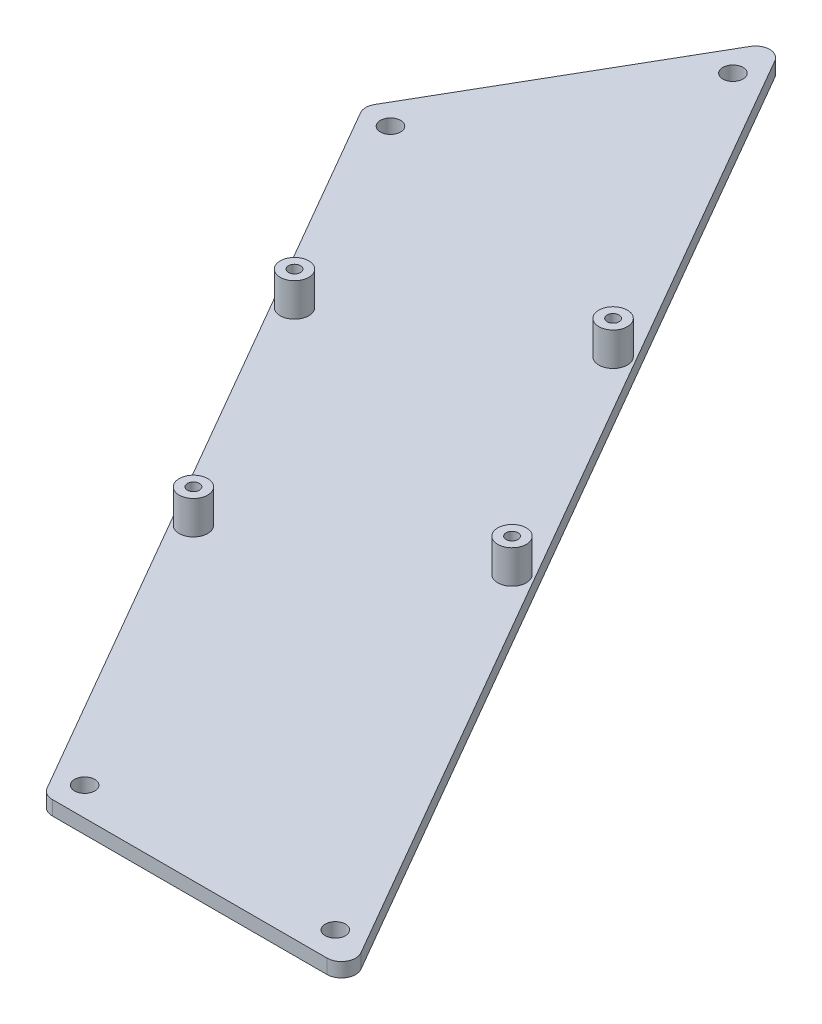
ISO-10303-21;
HEADER;
FILE_DESCRIPTION(('STEP AP214'),'2;1');
FILE_NAME('part.step','',(''),(''),'','','');
FILE_SCHEMA(('AUTOMOTIVE_DESIGN { 1 0 10303 214 1 1 1 1 }'));
ENDSEC;
DATA;
#1=APPLICATION_CONTEXT('core data for automotive mechanical design processes');
#2=APPLICATION_PROTOCOL_DEFINITION('international standard','automotive_design',2000,#1);
#3=PRODUCT_CONTEXT('',#1,'mechanical');
#4=PRODUCT('Part','Part','',(#3));
#5=PRODUCT_RELATED_PRODUCT_CATEGORY('part','',(#4));
#6=PRODUCT_DEFINITION_FORMATION('','',#4);
#7=PRODUCT_DEFINITION_CONTEXT('part definition',#1,'design');
#8=PRODUCT_DEFINITION('design','',#6,#7);
#9=PRODUCT_DEFINITION_SHAPE('','',#8);
#10=(LENGTH_UNIT() NAMED_UNIT(*) SI_UNIT(.MILLI.,.METRE.));
#11=(NAMED_UNIT(*) PLANE_ANGLE_UNIT() SI_UNIT($,.RADIAN.));
#12=(NAMED_UNIT(*) SI_UNIT($,.STERADIAN.) SOLID_ANGLE_UNIT());
#13=UNCERTAINTY_MEASURE_WITH_UNIT(LENGTH_MEASURE(1.E-05),#10,'distance_accuracy_value','');
#14=(GEOMETRIC_REPRESENTATION_CONTEXT(3) GLOBAL_UNCERTAINTY_ASSIGNED_CONTEXT((#13)) GLOBAL_UNIT_ASSIGNED_CONTEXT((#10,
#11,#12)) REPRESENTATION_CONTEXT('',''));
#15=CARTESIAN_POINT('',(0.,0.,0.));
#16=DIRECTION('',(0.,0.,1.));
#17=DIRECTION('',(1.,0.,0.));
#18=AXIS2_PLACEMENT_3D('',#15,#16,#17);
#19=CARTESIAN_POINT('',(173.,3.,6.00000000000005));
#20=DIRECTION('',(0.,0.,-1.));
#21=DIRECTION('',(-1.,0.,0.));
#22=AXIS2_PLACEMENT_3D('',#19,#20,#21);
#23=PLANE('',#22);
#24=DIRECTION('',(1.,0.,0.));
#25=VECTOR('',#24,1.);
#26=CARTESIAN_POINT('',(173.,3.,6.00000000000005));
#27=LINE('',#26,#25);
#28=CARTESIAN_POINT('',(174.732050807569,3.,6.00000000000005));
#29=VERTEX_POINT('',#28);
#30=CARTESIAN_POINT('',(232.467077726531,3.,6.00000000000005));
#31=VERTEX_POINT('',#30);
#32=EDGE_CURVE('E127',#29,#31,#27,.T.);
#33=ORIENTED_EDGE('',*,*,#32,.F.);
#34=DIRECTION('',(0.,-1.,0.));
#35=VECTOR('',#34,1.);
#36=CARTESIAN_POINT('',(174.732050807569,3.,6.00000000000005));
#37=LINE('',#36,#35);
#38=CARTESIAN_POINT('',(174.732050807569,0.,6.00000000000005));
#39=VERTEX_POINT('',#38);
#40=EDGE_CURVE('E11',#29,#39,#37,.T.);
#41=ORIENTED_EDGE('',*,*,#40,.T.);
#42=DIRECTION('',(1.,0.,0.));
#43=VECTOR('',#42,1.);
#44=CARTESIAN_POINT('',(173.,0.,6.00000000000005));
#45=LINE('',#44,#43);
#46=CARTESIAN_POINT('',(232.467077726531,0.,6.00000000000005));
#47=VERTEX_POINT('',#46);
#48=EDGE_CURVE('E158',#39,#47,#45,.T.);
#49=ORIENTED_EDGE('',*,*,#48,.T.);
#50=DIRECTION('',(0.,-1.,0.));
#51=VECTOR('',#50,1.);
#52=CARTESIAN_POINT('',(232.467077726531,3.,6.00000000000005));
#53=LINE('',#52,#51);
#54=EDGE_CURVE('E41',#47,#31,#53,.F.);
#55=ORIENTED_EDGE('',*,*,#54,.T.);
#56=EDGE_LOOP('',(#33,#41,#49,#55));
#57=FACE_BOUND('',#56,.T.);
#58=ADVANCED_FACE('F33',(#57),#23,.F.);
#59=CARTESIAN_POINT('',(237.663230149238,3.,6.00000000000005));
#60=DIRECTION('',(-0.866025403784439,0.,0.5));
#61=DIRECTION('',(0.5,0.,0.866025403784439));
#62=AXIS2_PLACEMENT_3D('',#59,#60,#61);
#63=PLANE('',#62);
#64=DIRECTION('',(-0.5,0.,-0.866025403784439));
#65=VECTOR('',#64,1.);
#66=CARTESIAN_POINT('',(237.663230149238,0.,6.00000000000005));
#67=LINE('',#66,#65);
#68=CARTESIAN_POINT('',(235.065153937885,0.,1.50000000000006));
#69=VERTEX_POINT('',#68);
#70=CARTESIAN_POINT('',(116.233538863266,0.,-204.322394854708));
#71=VERTEX_POINT('',#70);
#72=EDGE_CURVE('E132',#69,#71,#67,.T.);
#73=ORIENTED_EDGE('',*,*,#72,.T.);
#74=DIRECTION('',(0.,-1.,0.));
#75=VECTOR('',#74,1.);
#76=CARTESIAN_POINT('',(116.233538863266,3.,-204.322394854708));
#77=LINE('',#76,#75);
#78=CARTESIAN_POINT('',(116.233538863266,3.,-204.322394854708));
#79=VERTEX_POINT('',#78);
#80=EDGE_CURVE('E48',#71,#79,#77,.F.);
#81=ORIENTED_EDGE('',*,*,#80,.T.);
#82=DIRECTION('',(-0.5,0.,-0.866025403784439));
#83=VECTOR('',#82,1.);
#84=CARTESIAN_POINT('',(237.663230149238,3.,6.00000000000005));
#85=LINE('',#84,#83);
#86=CARTESIAN_POINT('',(235.065153937885,3.,1.50000000000006));
#87=VERTEX_POINT('',#86);
#88=EDGE_CURVE('E130',#87,#79,#85,.T.);
#89=ORIENTED_EDGE('',*,*,#88,.F.);
#90=DIRECTION('',(0.,-1.,0.));
#91=VECTOR('',#90,1.);
#92=CARTESIAN_POINT('',(235.065153937885,3.,1.50000000000005));
#93=LINE('',#92,#91);
#94=EDGE_CURVE('E150',#87,#69,#93,.T.);
#95=ORIENTED_EDGE('',*,*,#94,.T.);
#96=EDGE_LOOP('',(#73,#81,#89,#95));
#97=FACE_BOUND('',#96,.T.);
#98=ADVANCED_FACE('F165',(#97),#63,.F.);
#99=CARTESIAN_POINT('',(81.3038475772934,3.,-152.822394854708));
#100=DIRECTION('',(0.866025403784438,0.,0.500000000000001));
#101=DIRECTION('',(0.500000000000001,0.,-0.866025403784438));
#102=AXIS2_PLACEMENT_3D('',#99,#100,#101);
#103=PLANE('',#102);
#104=DIRECTION('',(-0.500000000000001,0.,0.866025403784438));
#105=VECTOR('',#104,1.);
#106=CARTESIAN_POINT('',(81.3038475772934,0.,-152.822394854708));
#107=LINE('',#106,#105);
#108=CARTESIAN_POINT('',(111.037386440559,0.,-204.322394854708));
#109=VERTEX_POINT('',#108);
#110=CARTESIAN_POINT('',(82.1698729810778,0.,-154.322394854708));
#111=VERTEX_POINT('',#110);
#112=EDGE_CURVE('E128',#109,#111,#107,.T.);
#113=ORIENTED_EDGE('',*,*,#112,.T.);
#114=DIRECTION('',(0.,-1.,0.));
#115=VECTOR('',#114,1.);
#116=CARTESIAN_POINT('',(82.1698729810778,3.,-154.322394854708));
#117=LINE('',#116,#115);
#118=CARTESIAN_POINT('',(82.1698729810778,3.,-154.322394854708));
#119=VERTEX_POINT('',#118);
#120=EDGE_CURVE('E105',#111,#119,#117,.F.);
#121=ORIENTED_EDGE('',*,*,#120,.T.);
#122=DIRECTION('',(-0.500000000000001,0.,0.866025403784438));
#123=VECTOR('',#122,1.);
#124=CARTESIAN_POINT('',(81.3038475772934,3.,-152.822394854708));
#125=LINE('',#124,#123);
#126=CARTESIAN_POINT('',(111.037386440559,3.,-204.322394854708));
#127=VERTEX_POINT('',#126);
#128=EDGE_CURVE('E170',#127,#119,#125,.T.);
#129=ORIENTED_EDGE('',*,*,#128,.F.);
#130=DIRECTION('',(0.,-1.,0.));
#131=VECTOR('',#130,1.);
#132=CARTESIAN_POINT('',(111.037386440559,3.,-204.322394854708));
#133=LINE('',#132,#131);
#134=EDGE_CURVE('E110',#127,#109,#133,.T.);
#135=ORIENTED_EDGE('',*,*,#134,.T.);
#136=EDGE_LOOP('',(#113,#121,#129,#135));
#137=FACE_BOUND('',#136,.T.);
#138=ADVANCED_FACE('F290',(#137),#103,.F.);
#139=CARTESIAN_POINT('',(81.3038475772934,3.,-152.822394854708));
#140=DIRECTION('',(0.866025403784439,0.,-0.5));
#141=DIRECTION('',(-0.5,0.,-0.866025403784439));
#142=AXIS2_PLACEMENT_3D('',#139,#140,#141);
#143=PLANE('',#142);
#144=DIRECTION('',(0.5,0.,0.866025403784439));
#145=VECTOR('',#144,1.);
#146=CARTESIAN_POINT('',(81.3038475772934,3.,-152.822394854708));
#147=LINE('',#146,#145);
#148=CARTESIAN_POINT('',(82.1698729810778,3.,-151.322394854708));
#149=VERTEX_POINT('',#148);
#150=CARTESIAN_POINT('',(172.133974596215,3.,4.5));
#151=VERTEX_POINT('',#150);
#152=EDGE_CURVE('E120',#149,#151,#147,.T.);
#153=ORIENTED_EDGE('',*,*,#152,.F.);
#154=DIRECTION('',(0.,-1.,0.));
#155=VECTOR('',#154,1.);
#156=CARTESIAN_POINT('',(82.1698729810778,3.,-151.322394854708));
#157=LINE('',#156,#155);
#158=CARTESIAN_POINT('',(82.1698729810778,0.,-151.322394854708));
#159=VERTEX_POINT('',#158);
#160=EDGE_CURVE('E104',#149,#159,#157,.T.);
#161=ORIENTED_EDGE('',*,*,#160,.T.);
#162=DIRECTION('',(0.5,0.,0.866025403784439));
#163=VECTOR('',#162,1.);
#164=CARTESIAN_POINT('',(81.3038475772934,0.,-152.822394854708));
#165=LINE('',#164,#163);
#166=CARTESIAN_POINT('',(172.133974596215,0.,4.5));
#167=VERTEX_POINT('',#166);
#168=EDGE_CURVE('E117',#159,#167,#165,.T.);
#169=ORIENTED_EDGE('',*,*,#168,.T.);
#170=DIRECTION('',(0.,-1.,0.));
#171=VECTOR('',#170,1.);
#172=CARTESIAN_POINT('',(172.133974596215,3.,4.50000000000003));
#173=LINE('',#172,#171);
#174=EDGE_CURVE('E122',#167,#151,#173,.F.);
#175=ORIENTED_EDGE('',*,*,#174,.T.);
#176=EDGE_LOOP('',(#153,#161,#169,#175));
#177=FACE_BOUND('',#176,.T.);
#178=ADVANCED_FACE('F116',(#177),#143,.F.);
#179=CARTESIAN_POINT('',(0.,3.,0.));
#180=DIRECTION('',(0.,1.,0.));
#181=DIRECTION('',(0.,0.,1.));
#182=AXIS2_PLACEMENT_3D('',#179,#180,#181);
#183=PLANE('',#182);
#184=CARTESIAN_POINT('',(87.7679491924311,3.,-152.018547277414));
#185=DIRECTION('',(0.,1.,0.));
#186=DIRECTION('',(0.,0.,1.));
#187=AXIS2_PLACEMENT_3D('',#184,#185,#186);
#188=CIRCLE('',#187,2.125);
#189=CARTESIAN_POINT('',(87.7679491924311,3.,-149.893547277414));
#190=VERTEX_POINT('',#189);
#191=EDGE_CURVE('E239',#190,#190,#188,.T.);
#192=ORIENTED_EDGE('',*,*,#191,.F.);
#193=EDGE_LOOP('',(#192));
#194=FACE_BOUND('',#193,.T.);
#195=CARTESIAN_POINT('',(114.09956426705,3.,-197.626242432001));
#196=DIRECTION('',(0.,1.,0.));
#197=DIRECTION('',(0.,0.,1.));
#198=AXIS2_PLACEMENT_3D('',#195,#196,#197);
#199=CIRCLE('',#198,2.125);
#200=CARTESIAN_POINT('',(114.09956426705,3.,-195.501242432001));
#201=VERTEX_POINT('',#200);
#202=EDGE_CURVE('E233',#201,#201,#199,.T.);
#203=ORIENTED_EDGE('',*,*,#202,.F.);
#204=EDGE_LOOP('',(#203));
#205=FACE_BOUND('',#204,.T.);
#206=CARTESIAN_POINT('',(175.535898384862,3.,0.));
#207=DIRECTION('',(0.,1.,0.));
#208=DIRECTION('',(0.,0.,1.));
#209=AXIS2_PLACEMENT_3D('',#206,#207,#208);
#210=CIRCLE('',#209,2.12499999999998);
#211=CARTESIAN_POINT('',(175.535898384862,3.,2.12500000000002));
#212=VERTEX_POINT('',#211);
#213=EDGE_CURVE('E227',#212,#212,#210,.T.);
#214=ORIENTED_EDGE('',*,*,#213,.F.);
#215=EDGE_LOOP('',(#214));
#216=FACE_BOUND('',#215,.T.);
#217=CARTESIAN_POINT('',(228.1991285341,3.,0.));
#218=DIRECTION('',(0.,1.,0.));
#219=DIRECTION('',(0.,0.,1.));
#220=AXIS2_PLACEMENT_3D('',#217,#218,#219);
#221=CIRCLE('',#220,2.12499999999998);
#222=CARTESIAN_POINT('',(228.1991285341,3.,2.12500000000002));
#223=VERTEX_POINT('',#222);
#224=EDGE_CURVE('E221',#223,#223,#221,.T.);
#225=ORIENTED_EDGE('',*,*,#224,.F.);
#226=EDGE_LOOP('',(#225));
#227=FACE_BOUND('',#226,.T.);
#228=CARTESIAN_POINT('',(139.683012701892,3.,-58.7067147554495));
#229=DIRECTION('',(0.,1.,0.));
#230=DIRECTION('',(0.,0.,1.));
#231=AXIS2_PLACEMENT_3D('',#228,#229,#230);
#232=CIRCLE('',#231,2.99999999999999);
#233=CARTESIAN_POINT('',(139.683012701892,3.,-55.7067147554495));
#234=VERTEX_POINT('',#233);
#235=EDGE_CURVE('E191',#234,#234,#232,.T.);
#236=ORIENTED_EDGE('',*,*,#235,.F.);
#237=EDGE_LOOP('',(#236));
#238=FACE_BOUND('',#237,.T.);
#239=CARTESIAN_POINT('',(182.11825748733,3.,-83.2067147554495));
#240=DIRECTION('',(0.,1.,0.));
#241=DIRECTION('',(0.,0.,1.));
#242=AXIS2_PLACEMENT_3D('',#239,#240,#241);
#243=CIRCLE('',#242,2.99999999999999);
#244=CARTESIAN_POINT('',(182.11825748733,3.,-80.2067147554496));
#245=VERTEX_POINT('',#244);
#246=EDGE_CURVE('E185',#245,#245,#243,.T.);
#247=ORIENTED_EDGE('',*,*,#246,.F.);
#248=EDGE_LOOP('',(#247));
#249=FACE_BOUND('',#248,.T.);
#250=CARTESIAN_POINT('',(153.11825748733,3.,-133.436188174947));
#251=DIRECTION('',(0.,1.,0.));
#252=DIRECTION('',(0.,0.,1.));
#253=AXIS2_PLACEMENT_3D('',#250,#251,#252);
#254=CIRCLE('',#253,2.99999999999999);
#255=CARTESIAN_POINT('',(153.11825748733,3.,-130.436188174947));
#256=VERTEX_POINT('',#255);
#257=EDGE_CURVE('E179',#256,#256,#254,.T.);
#258=ORIENTED_EDGE('',*,*,#257,.F.);
#259=EDGE_LOOP('',(#258));
#260=FACE_BOUND('',#259,.T.);
#261=CARTESIAN_POINT('',(110.683012701892,3.,-108.936188174947));
#262=DIRECTION('',(0.,1.,0.));
#263=DIRECTION('',(0.,0.,1.));
#264=AXIS2_PLACEMENT_3D('',#261,#262,#263);
#265=CIRCLE('',#264,3.);
#266=CARTESIAN_POINT('',(110.683012701892,3.,-105.936188174947));
#267=VERTEX_POINT('',#266);
#268=EDGE_CURVE('E173',#267,#267,#265,.T.);
#269=ORIENTED_EDGE('',*,*,#268,.F.);
#270=EDGE_LOOP('',(#269));
#271=FACE_BOUND('',#270,.T.);
#272=ORIENTED_EDGE('',*,*,#128,.T.);
#273=CARTESIAN_POINT('',(84.7679491924311,3.,-152.822394854708));
#274=DIRECTION('',(0.,1.,0.));
#275=DIRECTION('',(0.,0.,1.));
#276=AXIS2_PLACEMENT_3D('',#273,#274,#275);
#277=CIRCLE('',#276,3.);
#278=EDGE_CURVE('E148',#119,#149,#277,.T.);
#279=ORIENTED_EDGE('',*,*,#278,.T.);
#280=ORIENTED_EDGE('',*,*,#152,.T.);
#281=CARTESIAN_POINT('',(174.732050807569,3.,3.00000000000005));
#282=DIRECTION('',(0.,1.,0.));
#283=DIRECTION('',(0.,0.,1.));
#284=AXIS2_PLACEMENT_3D('',#281,#282,#283);
#285=CIRCLE('',#284,3.);
#286=EDGE_CURVE('E144',#151,#29,#285,.T.);
#287=ORIENTED_EDGE('',*,*,#286,.T.);
#288=ORIENTED_EDGE('',*,*,#32,.T.);
#289=CARTESIAN_POINT('',(232.467077726531,3.,3.00000000000005));
#290=DIRECTION('',(0.,1.,0.));
#291=DIRECTION('',(0.,0.,1.));
#292=AXIS2_PLACEMENT_3D('',#289,#290,#291);
#293=CIRCLE('',#292,3.);
#294=EDGE_CURVE('E55',#31,#87,#293,.T.);
#295=ORIENTED_EDGE('',*,*,#294,.T.);
#296=ORIENTED_EDGE('',*,*,#88,.T.);
#297=CARTESIAN_POINT('',(113.635462651912,3.,-202.822394854708));
#298=DIRECTION('',(0.,1.,0.));
#299=DIRECTION('',(0.,0.,1.));
#300=AXIS2_PLACEMENT_3D('',#297,#298,#299);
#301=CIRCLE('',#300,3.);
#302=EDGE_CURVE('E146',#79,#127,#301,.T.);
#303=ORIENTED_EDGE('',*,*,#302,.T.);
#304=EDGE_LOOP('',(#272,#279,#280,#287,#288,#295,#296,#303));
#305=FACE_BOUND('',#304,.T.);
#306=ADVANCED_FACE('F161',(#194,#205,#216,#227,#238,#249,#260,#271,#305),#183,.T.);
#307=CARTESIAN_POINT('',(0.,0.,0.));
#308=DIRECTION('',(0.,1.,0.));
#309=DIRECTION('',(0.,0.,1.));
#310=AXIS2_PLACEMENT_3D('',#307,#308,#309);
#311=PLANE('',#310);
#312=CARTESIAN_POINT('',(87.7679491924311,0.,-152.018547277414));
#313=DIRECTION('',(0.,1.,0.));
#314=DIRECTION('',(0.,0.,1.));
#315=AXIS2_PLACEMENT_3D('',#312,#313,#314);
#316=CIRCLE('',#315,2.125);
#317=CARTESIAN_POINT('',(87.7679491924311,0.,-149.893547277414));
#318=VERTEX_POINT('',#317);
#319=EDGE_CURVE('E201',#318,#318,#316,.T.);
#320=ORIENTED_EDGE('',*,*,#319,.T.);
#321=EDGE_LOOP('',(#320));
#322=FACE_BOUND('',#321,.T.);
#323=CARTESIAN_POINT('',(114.09956426705,0.,-197.626242432001));
#324=DIRECTION('',(0.,1.,0.));
#325=DIRECTION('',(0.,0.,1.));
#326=AXIS2_PLACEMENT_3D('',#323,#324,#325);
#327=CIRCLE('',#326,2.125);
#328=CARTESIAN_POINT('',(114.09956426705,0.,-195.501242432001));
#329=VERTEX_POINT('',#328);
#330=EDGE_CURVE('E236',#329,#329,#327,.T.);
#331=ORIENTED_EDGE('',*,*,#330,.T.);
#332=EDGE_LOOP('',(#331));
#333=FACE_BOUND('',#332,.T.);
#334=CARTESIAN_POINT('',(175.535898384862,0.,0.));
#335=DIRECTION('',(0.,1.,0.));
#336=DIRECTION('',(0.,0.,1.));
#337=AXIS2_PLACEMENT_3D('',#334,#335,#336);
#338=CIRCLE('',#337,2.12499999999998);
#339=CARTESIAN_POINT('',(175.535898384862,0.,2.12500000000002));
#340=VERTEX_POINT('',#339);
#341=EDGE_CURVE('E230',#340,#340,#338,.T.);
#342=ORIENTED_EDGE('',*,*,#341,.T.);
#343=EDGE_LOOP('',(#342));
#344=FACE_BOUND('',#343,.T.);
#345=CARTESIAN_POINT('',(228.1991285341,0.,0.));
#346=DIRECTION('',(0.,1.,0.));
#347=DIRECTION('',(0.,0.,1.));
#348=AXIS2_PLACEMENT_3D('',#345,#346,#347);
#349=CIRCLE('',#348,2.12499999999998);
#350=CARTESIAN_POINT('',(228.1991285341,0.,2.12500000000002));
#351=VERTEX_POINT('',#350);
#352=EDGE_CURVE('E224',#351,#351,#349,.T.);
#353=ORIENTED_EDGE('',*,*,#352,.T.);
#354=EDGE_LOOP('',(#353));
#355=FACE_BOUND('',#354,.T.);
#356=CARTESIAN_POINT('',(110.683012701892,0.,-108.936188174947));
#357=DIRECTION('',(0.,1.,0.));
#358=DIRECTION('',(0.,0.,1.));
#359=AXIS2_PLACEMENT_3D('',#356,#357,#358);
#360=CIRCLE('',#359,1.25);
#361=CARTESIAN_POINT('',(110.683012701892,0.,-107.686188174947));
#362=VERTEX_POINT('',#361);
#363=EDGE_CURVE('E194',#362,#362,#360,.T.);
#364=ORIENTED_EDGE('',*,*,#363,.T.);
#365=EDGE_LOOP('',(#364));
#366=FACE_BOUND('',#365,.T.);
#367=CARTESIAN_POINT('',(153.11825748733,0.,-133.436188174947));
#368=DIRECTION('',(0.,1.,0.));
#369=DIRECTION('',(0.,0.,1.));
#370=AXIS2_PLACEMENT_3D('',#367,#368,#369);
#371=CIRCLE('',#370,1.25000000000001);
#372=CARTESIAN_POINT('',(153.11825748733,0.,-132.186188174947));
#373=VERTEX_POINT('',#372);
#374=EDGE_CURVE('E213',#373,#373,#371,.T.);
#375=ORIENTED_EDGE('',*,*,#374,.T.);
#376=EDGE_LOOP('',(#375));
#377=FACE_BOUND('',#376,.T.);
#378=CARTESIAN_POINT('',(182.11825748733,0.,-83.2067147554495));
#379=DIRECTION('',(0.,1.,0.));
#380=DIRECTION('',(0.,0.,1.));
#381=AXIS2_PLACEMENT_3D('',#378,#379,#380);
#382=CIRCLE('',#381,1.25000000000001);
#383=CARTESIAN_POINT('',(182.11825748733,0.,-81.9567147554495));
#384=VERTEX_POINT('',#383);
#385=EDGE_CURVE('E207',#384,#384,#382,.T.);
#386=ORIENTED_EDGE('',*,*,#385,.T.);
#387=EDGE_LOOP('',(#386));
#388=FACE_BOUND('',#387,.T.);
#389=CARTESIAN_POINT('',(139.683012701892,0.,-58.7067147554495));
#390=DIRECTION('',(0.,1.,0.));
#391=DIRECTION('',(0.,0.,1.));
#392=AXIS2_PLACEMENT_3D('',#389,#390,#391);
#393=CIRCLE('',#392,1.25000000000001);
#394=CARTESIAN_POINT('',(139.683012701892,0.,-57.4567147554495));
#395=VERTEX_POINT('',#394);
#396=EDGE_CURVE('E200',#395,#395,#393,.T.);
#397=ORIENTED_EDGE('',*,*,#396,.T.);
#398=EDGE_LOOP('',(#397));
#399=FACE_BOUND('',#398,.T.);
#400=ORIENTED_EDGE('',*,*,#168,.F.);
#401=CARTESIAN_POINT('',(84.7679491924311,0.,-152.822394854708));
#402=DIRECTION('',(0.,1.,0.));
#403=DIRECTION('',(0.,0.,1.));
#404=AXIS2_PLACEMENT_3D('',#401,#402,#403);
#405=CIRCLE('',#404,3.);
#406=EDGE_CURVE('E100',#159,#111,#405,.F.);
#407=ORIENTED_EDGE('',*,*,#406,.T.);
#408=ORIENTED_EDGE('',*,*,#112,.F.);
#409=CARTESIAN_POINT('',(113.635462651912,0.,-202.822394854708));
#410=DIRECTION('',(0.,1.,0.));
#411=DIRECTION('',(0.,0.,1.));
#412=AXIS2_PLACEMENT_3D('',#409,#410,#411);
#413=CIRCLE('',#412,3.);
#414=EDGE_CURVE('E111',#109,#71,#413,.F.);
#415=ORIENTED_EDGE('',*,*,#414,.T.);
#416=ORIENTED_EDGE('',*,*,#72,.F.);
#417=CARTESIAN_POINT('',(232.467077726531,0.,3.00000000000005));
#418=DIRECTION('',(0.,1.,0.));
#419=DIRECTION('',(0.,0.,1.));
#420=AXIS2_PLACEMENT_3D('',#417,#418,#419);
#421=CIRCLE('',#420,3.);
#422=EDGE_CURVE('E121',#69,#47,#421,.F.);
#423=ORIENTED_EDGE('',*,*,#422,.T.);
#424=ORIENTED_EDGE('',*,*,#48,.F.);
#425=CARTESIAN_POINT('',(174.732050807569,0.,3.00000000000005));
#426=DIRECTION('',(0.,1.,0.));
#427=DIRECTION('',(0.,0.,1.));
#428=AXIS2_PLACEMENT_3D('',#425,#426,#427);
#429=CIRCLE('',#428,3.);
#430=EDGE_CURVE('E126',#39,#167,#429,.F.);
#431=ORIENTED_EDGE('',*,*,#430,.T.);
#432=EDGE_LOOP('',(#400,#407,#408,#415,#416,#423,#424,#431));
#433=FACE_BOUND('',#432,.T.);
#434=ADVANCED_FACE('F124',(#322,#333,#344,#355,#366,#377,#388,#399,#433),#311,.F.);
#435=CARTESIAN_POINT('',(84.7679491924311,3.,-152.822394854708));
#436=DIRECTION('',(0.,-1.,0.));
#437=DIRECTION('',(0.,0.,-1.));
#438=AXIS2_PLACEMENT_3D('',#435,#436,#437);
#439=CYLINDRICAL_SURFACE('',#438,3.);
#440=ORIENTED_EDGE('',*,*,#278,.F.);
#441=ORIENTED_EDGE('',*,*,#120,.F.);
#442=ORIENTED_EDGE('',*,*,#406,.F.);
#443=ORIENTED_EDGE('',*,*,#160,.F.);
#444=EDGE_LOOP('',(#440,#441,#442,#443));
#445=FACE_BOUND('',#444,.T.);
#446=ADVANCED_FACE('F103',(#445),#439,.T.);
#447=CARTESIAN_POINT('',(113.635462651912,3.,-202.822394854708));
#448=DIRECTION('',(0.,-1.,0.));
#449=DIRECTION('',(0.,0.,-1.));
#450=AXIS2_PLACEMENT_3D('',#447,#448,#449);
#451=CYLINDRICAL_SURFACE('',#450,3.);
#452=ORIENTED_EDGE('',*,*,#302,.F.);
#453=ORIENTED_EDGE('',*,*,#80,.F.);
#454=ORIENTED_EDGE('',*,*,#414,.F.);
#455=ORIENTED_EDGE('',*,*,#134,.F.);
#456=EDGE_LOOP('',(#452,#453,#454,#455));
#457=FACE_BOUND('',#456,.T.);
#458=ADVANCED_FACE('F296',(#457),#451,.T.);
#459=CARTESIAN_POINT('',(174.732050807569,3.,3.00000000000005));
#460=DIRECTION('',(0.,-1.,0.));
#461=DIRECTION('',(0.,0.,-1.));
#462=AXIS2_PLACEMENT_3D('',#459,#460,#461);
#463=CYLINDRICAL_SURFACE('',#462,3.);
#464=ORIENTED_EDGE('',*,*,#286,.F.);
#465=ORIENTED_EDGE('',*,*,#174,.F.);
#466=ORIENTED_EDGE('',*,*,#430,.F.);
#467=ORIENTED_EDGE('',*,*,#40,.F.);
#468=EDGE_LOOP('',(#464,#465,#466,#467));
#469=FACE_BOUND('',#468,.T.);
#470=ADVANCED_FACE('F283',(#469),#463,.T.);
#471=CARTESIAN_POINT('',(232.467077726531,3.,3.00000000000005));
#472=DIRECTION('',(0.,-1.,0.));
#473=DIRECTION('',(0.,0.,-1.));
#474=AXIS2_PLACEMENT_3D('',#471,#472,#473);
#475=CYLINDRICAL_SURFACE('',#474,3.);
#476=ORIENTED_EDGE('',*,*,#294,.F.);
#477=ORIENTED_EDGE('',*,*,#54,.F.);
#478=ORIENTED_EDGE('',*,*,#422,.F.);
#479=ORIENTED_EDGE('',*,*,#94,.F.);
#480=EDGE_LOOP('',(#476,#477,#478,#479));
#481=FACE_BOUND('',#480,.T.);
#482=ADVANCED_FACE('F35',(#481),#475,.T.);
#483=CARTESIAN_POINT('',(110.683012701892,10.,-108.936188174947));
#484=DIRECTION('',(0.,-1.,0.));
#485=DIRECTION('',(0.,0.,-1.));
#486=AXIS2_PLACEMENT_3D('',#483,#484,#485);
#487=CYLINDRICAL_SURFACE('',#486,3.);
#488=CARTESIAN_POINT('',(110.683012701892,10.,-108.936188174947));
#489=DIRECTION('',(0.,1.,0.));
#490=DIRECTION('',(0.,0.,1.));
#491=AXIS2_PLACEMENT_3D('',#488,#489,#490);
#492=CIRCLE('',#491,3.);
#493=CARTESIAN_POINT('',(110.683012701892,10.,-105.936188174947));
#494=VERTEX_POINT('',#493);
#495=EDGE_CURVE('E166',#494,#494,#492,.T.);
#496=ORIENTED_EDGE('',*,*,#495,.F.);
#497=EDGE_LOOP('',(#496));
#498=FACE_BOUND('',#497,.T.);
#499=ORIENTED_EDGE('',*,*,#268,.T.);
#500=EDGE_LOOP('',(#499));
#501=FACE_BOUND('',#500,.T.);
#502=ADVANCED_FACE('F271',(#498,#501),#487,.T.);
#503=CARTESIAN_POINT('',(110.683012701892,10.,-108.936188174947));
#504=DIRECTION('',(0.,1.,0.));
#505=DIRECTION('',(0.,0.,1.));
#506=AXIS2_PLACEMENT_3D('',#503,#504,#505);
#507=PLANE('',#506);
#508=CARTESIAN_POINT('',(110.683012701892,10.,-108.936188174947));
#509=DIRECTION('',(0.,1.,0.));
#510=DIRECTION('',(0.,0.,1.));
#511=AXIS2_PLACEMENT_3D('',#508,#509,#510);
#512=CIRCLE('',#511,1.25);
#513=CARTESIAN_POINT('',(110.683012701892,10.,-107.686188174947));
#514=VERTEX_POINT('',#513);
#515=EDGE_CURVE('E216',#514,#514,#512,.T.);
#516=ORIENTED_EDGE('',*,*,#515,.F.);
#517=EDGE_LOOP('',(#516));
#518=FACE_BOUND('',#517,.T.);
#519=ORIENTED_EDGE('',*,*,#495,.T.);
#520=EDGE_LOOP('',(#519));
#521=FACE_BOUND('',#520,.T.);
#522=ADVANCED_FACE('F273',(#518,#521),#507,.T.);
#523=CARTESIAN_POINT('',(153.11825748733,10.,-133.436188174947));
#524=DIRECTION('',(0.,-1.,0.));
#525=DIRECTION('',(0.,0.,-1.));
#526=AXIS2_PLACEMENT_3D('',#523,#524,#525);
#527=CYLINDRICAL_SURFACE('',#526,2.99999999999999);
#528=CARTESIAN_POINT('',(153.11825748733,10.,-133.436188174947));
#529=DIRECTION('',(0.,1.,0.));
#530=DIRECTION('',(0.,0.,1.));
#531=AXIS2_PLACEMENT_3D('',#528,#529,#530);
#532=CIRCLE('',#531,2.99999999999999);
#533=CARTESIAN_POINT('',(153.11825748733,10.,-130.436188174947));
#534=VERTEX_POINT('',#533);
#535=EDGE_CURVE('E176',#534,#534,#532,.T.);
#536=ORIENTED_EDGE('',*,*,#535,.F.);
#537=EDGE_LOOP('',(#536));
#538=FACE_BOUND('',#537,.T.);
#539=ORIENTED_EDGE('',*,*,#257,.T.);
#540=EDGE_LOOP('',(#539));
#541=FACE_BOUND('',#540,.T.);
#542=ADVANCED_FACE('F280',(#538,#541),#527,.T.);
#543=CARTESIAN_POINT('',(153.11825748733,10.,-133.436188174947));
#544=DIRECTION('',(0.,1.,0.));
#545=DIRECTION('',(0.,0.,1.));
#546=AXIS2_PLACEMENT_3D('',#543,#544,#545);
#547=PLANE('',#546);
#548=CARTESIAN_POINT('',(153.11825748733,10.,-133.436188174947));
#549=DIRECTION('',(0.,1.,0.));
#550=DIRECTION('',(0.,0.,1.));
#551=AXIS2_PLACEMENT_3D('',#548,#549,#550);
#552=CIRCLE('',#551,1.25000000000001);
#553=CARTESIAN_POINT('',(153.11825748733,10.,-132.186188174947));
#554=VERTEX_POINT('',#553);
#555=EDGE_CURVE('E210',#554,#554,#552,.T.);
#556=ORIENTED_EDGE('',*,*,#555,.F.);
#557=EDGE_LOOP('',(#556));
#558=FACE_BOUND('',#557,.T.);
#559=ORIENTED_EDGE('',*,*,#535,.T.);
#560=EDGE_LOOP('',(#559));
#561=FACE_BOUND('',#560,.T.);
#562=ADVANCED_FACE('F352',(#558,#561),#547,.T.);
#563=CARTESIAN_POINT('',(182.11825748733,10.,-83.2067147554495));
#564=DIRECTION('',(0.,-1.,0.));
#565=DIRECTION('',(0.,0.,-1.));
#566=AXIS2_PLACEMENT_3D('',#563,#564,#565);
#567=CYLINDRICAL_SURFACE('',#566,2.99999999999999);
#568=CARTESIAN_POINT('',(182.11825748733,10.,-83.2067147554495));
#569=DIRECTION('',(0.,1.,0.));
#570=DIRECTION('',(0.,0.,1.));
#571=AXIS2_PLACEMENT_3D('',#568,#569,#570);
#572=CIRCLE('',#571,2.99999999999999);
#573=CARTESIAN_POINT('',(182.11825748733,10.,-80.2067147554496));
#574=VERTEX_POINT('',#573);
#575=EDGE_CURVE('E182',#574,#574,#572,.T.);
#576=ORIENTED_EDGE('',*,*,#575,.F.);
#577=EDGE_LOOP('',(#576));
#578=FACE_BOUND('',#577,.T.);
#579=ORIENTED_EDGE('',*,*,#246,.T.);
#580=EDGE_LOOP('',(#579));
#581=FACE_BOUND('',#580,.T.);
#582=ADVANCED_FACE('F360',(#578,#581),#567,.T.);
#583=CARTESIAN_POINT('',(182.11825748733,10.,-83.2067147554495));
#584=DIRECTION('',(0.,1.,0.));
#585=DIRECTION('',(0.,0.,1.));
#586=AXIS2_PLACEMENT_3D('',#583,#584,#585);
#587=PLANE('',#586);
#588=CARTESIAN_POINT('',(182.11825748733,10.,-83.2067147554495));
#589=DIRECTION('',(0.,1.,0.));
#590=DIRECTION('',(0.,0.,1.));
#591=AXIS2_PLACEMENT_3D('',#588,#589,#590);
#592=CIRCLE('',#591,1.25000000000001);
#593=CARTESIAN_POINT('',(182.11825748733,10.,-81.9567147554495));
#594=VERTEX_POINT('',#593);
#595=EDGE_CURVE('E204',#594,#594,#592,.T.);
#596=ORIENTED_EDGE('',*,*,#595,.F.);
#597=EDGE_LOOP('',(#596));
#598=FACE_BOUND('',#597,.T.);
#599=ORIENTED_EDGE('',*,*,#575,.T.);
#600=EDGE_LOOP('',(#599));
#601=FACE_BOUND('',#600,.T.);
#602=ADVANCED_FACE('F365',(#598,#601),#587,.T.);
#603=CARTESIAN_POINT('',(139.683012701892,10.,-58.7067147554495));
#604=DIRECTION('',(0.,-1.,0.));
#605=DIRECTION('',(0.,0.,-1.));
#606=AXIS2_PLACEMENT_3D('',#603,#604,#605);
#607=CYLINDRICAL_SURFACE('',#606,2.99999999999999);
#608=CARTESIAN_POINT('',(139.683012701892,10.,-58.7067147554495));
#609=DIRECTION('',(0.,1.,0.));
#610=DIRECTION('',(0.,0.,1.));
#611=AXIS2_PLACEMENT_3D('',#608,#609,#610);
#612=CIRCLE('',#611,2.99999999999999);
#613=CARTESIAN_POINT('',(139.683012701892,10.,-55.7067147554495));
#614=VERTEX_POINT('',#613);
#615=EDGE_CURVE('E188',#614,#614,#612,.T.);
#616=ORIENTED_EDGE('',*,*,#615,.F.);
#617=EDGE_LOOP('',(#616));
#618=FACE_BOUND('',#617,.T.);
#619=ORIENTED_EDGE('',*,*,#235,.T.);
#620=EDGE_LOOP('',(#619));
#621=FACE_BOUND('',#620,.T.);
#622=ADVANCED_FACE('F373',(#618,#621),#607,.T.);
#623=CARTESIAN_POINT('',(139.683012701892,10.,-58.7067147554495));
#624=DIRECTION('',(0.,1.,0.));
#625=DIRECTION('',(0.,0.,1.));
#626=AXIS2_PLACEMENT_3D('',#623,#624,#625);
#627=PLANE('',#626);
#628=CARTESIAN_POINT('',(139.683012701892,10.,-58.7067147554495));
#629=DIRECTION('',(0.,1.,0.));
#630=DIRECTION('',(0.,0.,1.));
#631=AXIS2_PLACEMENT_3D('',#628,#629,#630);
#632=CIRCLE('',#631,1.25000000000001);
#633=CARTESIAN_POINT('',(139.683012701892,10.,-57.4567147554495));
#634=VERTEX_POINT('',#633);
#635=EDGE_CURVE('E197',#634,#634,#632,.T.);
#636=ORIENTED_EDGE('',*,*,#635,.F.);
#637=EDGE_LOOP('',(#636));
#638=FACE_BOUND('',#637,.T.);
#639=ORIENTED_EDGE('',*,*,#615,.T.);
#640=EDGE_LOOP('',(#639));
#641=FACE_BOUND('',#640,.T.);
#642=ADVANCED_FACE('F378',(#638,#641),#627,.T.);
#643=CARTESIAN_POINT('',(139.683012701892,0.,-58.7067147554495));
#644=DIRECTION('',(0.,1.,0.));
#645=DIRECTION('',(0.,0.,1.));
#646=AXIS2_PLACEMENT_3D('',#643,#644,#645);
#647=CYLINDRICAL_SURFACE('',#646,1.25000000000001);
#648=ORIENTED_EDGE('',*,*,#396,.F.);
#649=EDGE_LOOP('',(#648));
#650=FACE_BOUND('',#649,.T.);
#651=ORIENTED_EDGE('',*,*,#635,.T.);
#652=EDGE_LOOP('',(#651));
#653=FACE_BOUND('',#652,.T.);
#654=ADVANCED_FACE('F407',(#650,#653),#647,.F.);
#655=CARTESIAN_POINT('',(182.11825748733,0.,-83.2067147554495));
#656=DIRECTION('',(0.,1.,0.));
#657=DIRECTION('',(0.,0.,1.));
#658=AXIS2_PLACEMENT_3D('',#655,#656,#657);
#659=CYLINDRICAL_SURFACE('',#658,1.25000000000001);
#660=ORIENTED_EDGE('',*,*,#385,.F.);
#661=EDGE_LOOP('',(#660));
#662=FACE_BOUND('',#661,.T.);
#663=ORIENTED_EDGE('',*,*,#595,.T.);
#664=EDGE_LOOP('',(#663));
#665=FACE_BOUND('',#664,.T.);
#666=ADVANCED_FACE('F417',(#662,#665),#659,.F.);
#667=CARTESIAN_POINT('',(153.11825748733,0.,-133.436188174947));
#668=DIRECTION('',(0.,1.,0.));
#669=DIRECTION('',(0.,0.,1.));
#670=AXIS2_PLACEMENT_3D('',#667,#668,#669);
#671=CYLINDRICAL_SURFACE('',#670,1.25000000000001);
#672=ORIENTED_EDGE('',*,*,#374,.F.);
#673=EDGE_LOOP('',(#672));
#674=FACE_BOUND('',#673,.T.);
#675=ORIENTED_EDGE('',*,*,#555,.T.);
#676=EDGE_LOOP('',(#675));
#677=FACE_BOUND('',#676,.T.);
#678=ADVANCED_FACE('F427',(#674,#677),#671,.F.);
#679=CARTESIAN_POINT('',(110.683012701892,0.,-108.936188174947));
#680=DIRECTION('',(0.,1.,0.));
#681=DIRECTION('',(0.,0.,1.));
#682=AXIS2_PLACEMENT_3D('',#679,#680,#681);
#683=CYLINDRICAL_SURFACE('',#682,1.25);
#684=ORIENTED_EDGE('',*,*,#363,.F.);
#685=EDGE_LOOP('',(#684));
#686=FACE_BOUND('',#685,.T.);
#687=ORIENTED_EDGE('',*,*,#515,.T.);
#688=EDGE_LOOP('',(#687));
#689=FACE_BOUND('',#688,.T.);
#690=ADVANCED_FACE('F437',(#686,#689),#683,.F.);
#691=CARTESIAN_POINT('',(228.1991285341,0.,0.));
#692=DIRECTION('',(0.,1.,0.));
#693=DIRECTION('',(0.,0.,1.));
#694=AXIS2_PLACEMENT_3D('',#691,#692,#693);
#695=CYLINDRICAL_SURFACE('',#694,2.12499999999998);
#696=ORIENTED_EDGE('',*,*,#352,.F.);
#697=EDGE_LOOP('',(#696));
#698=FACE_BOUND('',#697,.T.);
#699=ORIENTED_EDGE('',*,*,#224,.T.);
#700=EDGE_LOOP('',(#699));
#701=FACE_BOUND('',#700,.T.);
#702=ADVANCED_FACE('F446',(#698,#701),#695,.F.);
#703=CARTESIAN_POINT('',(175.535898384862,0.,0.));
#704=DIRECTION('',(0.,1.,0.));
#705=DIRECTION('',(0.,0.,1.));
#706=AXIS2_PLACEMENT_3D('',#703,#704,#705);
#707=CYLINDRICAL_SURFACE('',#706,2.12499999999998);
#708=ORIENTED_EDGE('',*,*,#341,.F.);
#709=EDGE_LOOP('',(#708));
#710=FACE_BOUND('',#709,.T.);
#711=ORIENTED_EDGE('',*,*,#213,.T.);
#712=EDGE_LOOP('',(#711));
#713=FACE_BOUND('',#712,.T.);
#714=ADVANCED_FACE('F483',(#710,#713),#707,.F.);
#715=CARTESIAN_POINT('',(114.09956426705,0.,-197.626242432001));
#716=DIRECTION('',(0.,1.,0.));
#717=DIRECTION('',(0.,0.,1.));
#718=AXIS2_PLACEMENT_3D('',#715,#716,#717);
#719=CYLINDRICAL_SURFACE('',#718,2.125);
#720=ORIENTED_EDGE('',*,*,#330,.F.);
#721=EDGE_LOOP('',(#720));
#722=FACE_BOUND('',#721,.T.);
#723=ORIENTED_EDGE('',*,*,#202,.T.);
#724=EDGE_LOOP('',(#723));
#725=FACE_BOUND('',#724,.T.);
#726=ADVANCED_FACE('F250',(#722,#725),#719,.F.);
#727=CARTESIAN_POINT('',(87.7679491924311,0.,-152.018547277414));
#728=DIRECTION('',(0.,1.,0.));
#729=DIRECTION('',(0.,0.,1.));
#730=AXIS2_PLACEMENT_3D('',#727,#728,#729);
#731=CYLINDRICAL_SURFACE('',#730,2.125);
#732=ORIENTED_EDGE('',*,*,#319,.F.);
#733=EDGE_LOOP('',(#732));
#734=FACE_BOUND('',#733,.T.);
#735=ORIENTED_EDGE('',*,*,#191,.T.);
#736=EDGE_LOOP('',(#735));
#737=FACE_BOUND('',#736,.T.);
#738=ADVANCED_FACE('F247',(#734,#737),#731,.F.);
#739=CLOSED_SHELL('',(#58,#98,#138,#178,#306,#434,#446,#458,#470,#482,#502,#522,#542,#562,#582,
#602,#622,#642,#654,#666,#678,#690,#702,#714,#726,#738));
#740=MANIFOLD_SOLID_BREP('B2',#739);
#741=ADVANCED_BREP_SHAPE_REPRESENTATION('',(#18,#740),#14);
#742=SHAPE_DEFINITION_REPRESENTATION(#9,#741);
ENDSEC;
END-ISO-10303-21;
